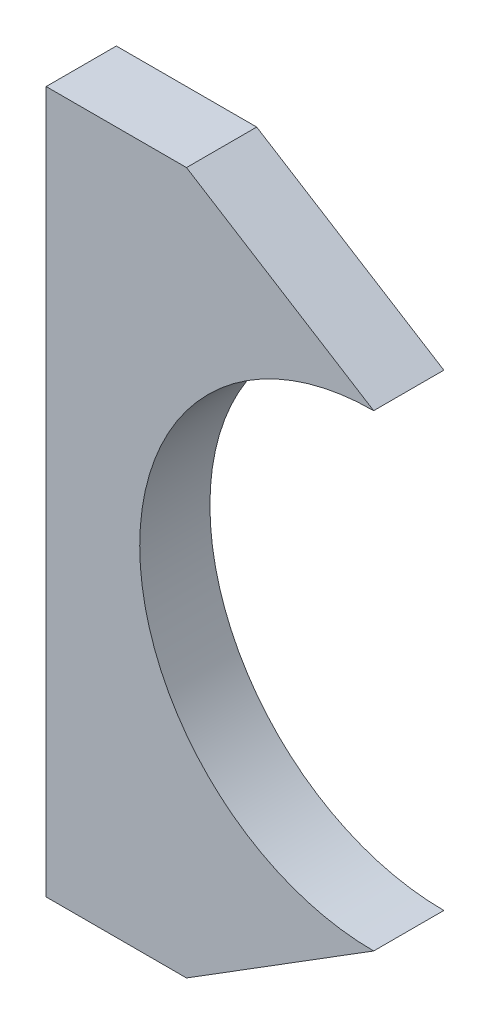
ISO-10303-21;
HEADER;
FILE_DESCRIPTION(('STEP AP214'),'2;1');
FILE_NAME('part.step','',(''),(''),'','','');
FILE_SCHEMA(('AUTOMOTIVE_DESIGN { 1 0 10303 214 1 1 1 1 }'));
ENDSEC;
DATA;
#1=APPLICATION_CONTEXT('core data for automotive mechanical design processes');
#2=APPLICATION_PROTOCOL_DEFINITION('international standard','automotive_design',2000,#1);
#3=PRODUCT_CONTEXT('',#1,'mechanical');
#4=PRODUCT('Part','Part','',(#3));
#5=PRODUCT_RELATED_PRODUCT_CATEGORY('part','',(#4));
#6=PRODUCT_DEFINITION_FORMATION('','',#4);
#7=PRODUCT_DEFINITION_CONTEXT('part definition',#1,'design');
#8=PRODUCT_DEFINITION('design','',#6,#7);
#9=PRODUCT_DEFINITION_SHAPE('','',#8);
#10=(LENGTH_UNIT() NAMED_UNIT(*) SI_UNIT(.MILLI.,.METRE.));
#11=(NAMED_UNIT(*) PLANE_ANGLE_UNIT() SI_UNIT($,.RADIAN.));
#12=(NAMED_UNIT(*) SI_UNIT($,.STERADIAN.) SOLID_ANGLE_UNIT());
#13=UNCERTAINTY_MEASURE_WITH_UNIT(LENGTH_MEASURE(1.E-05),#10,'distance_accuracy_value','');
#14=(GEOMETRIC_REPRESENTATION_CONTEXT(3) GLOBAL_UNCERTAINTY_ASSIGNED_CONTEXT((#13)) GLOBAL_UNIT_ASSIGNED_CONTEXT((#10,
#11,#12)) REPRESENTATION_CONTEXT('',''));
#15=CARTESIAN_POINT('',(0.,0.,0.));
#16=DIRECTION('',(0.,0.,1.));
#17=DIRECTION('',(1.,0.,0.));
#18=AXIS2_PLACEMENT_3D('',#15,#16,#17);
#19=CARTESIAN_POINT('',(0.,0.,7.5));
#20=DIRECTION('',(0.,0.,-1.));
#21=DIRECTION('',(-1.,0.,0.));
#22=AXIS2_PLACEMENT_3D('',#19,#20,#21);
#23=CYLINDRICAL_SURFACE('',#22,50.);
#24=CARTESIAN_POINT('',(0.,0.,-7.5));
#25=DIRECTION('',(0.,0.,-1.));
#26=DIRECTION('',(1.,0.,0.));
#27=AXIS2_PLACEMENT_3D('',#24,#25,#26);
#28=CIRCLE('',#27,50.);
#29=CARTESIAN_POINT('',(0.,-50.,-7.5));
#30=VERTEX_POINT('',#29);
#31=CARTESIAN_POINT('',(0.,50.,-7.5));
#32=VERTEX_POINT('',#31);
#33=EDGE_CURVE('E117',#30,#32,#28,.T.);
#34=ORIENTED_EDGE('',*,*,#33,.T.);
#35=DIRECTION('',(0.,0.,-1.));
#36=VECTOR('',#35,1.);
#37=CARTESIAN_POINT('',(0.,50.,7.5));
#38=LINE('',#37,#36);
#39=CARTESIAN_POINT('',(0.,50.,7.5));
#40=VERTEX_POINT('',#39);
#41=EDGE_CURVE('E11',#40,#32,#38,.T.);
#42=ORIENTED_EDGE('',*,*,#41,.F.);
#43=CARTESIAN_POINT('',(0.,0.,7.5));
#44=DIRECTION('',(0.,0.,-1.));
#45=DIRECTION('',(1.,0.,0.));
#46=AXIS2_PLACEMENT_3D('',#43,#44,#45);
#47=CIRCLE('',#46,50.);
#48=CARTESIAN_POINT('',(0.,-50.,7.5));
#49=VERTEX_POINT('',#48);
#50=EDGE_CURVE('E127',#49,#40,#47,.T.);
#51=ORIENTED_EDGE('',*,*,#50,.F.);
#52=DIRECTION('',(0.,0.,-1.));
#53=VECTOR('',#52,1.);
#54=CARTESIAN_POINT('',(0.,-50.,7.5));
#55=LINE('',#54,#53);
#56=EDGE_CURVE('E113',#49,#30,#55,.T.);
#57=ORIENTED_EDGE('',*,*,#56,.T.);
#58=EDGE_LOOP('',(#34,#42,#51,#57));
#59=FACE_BOUND('',#58,.T.);
#60=ADVANCED_FACE('F33',(#59),#23,.F.);
#61=CARTESIAN_POINT('',(0.,50.,7.5));
#62=DIRECTION('',(-0.52999894000318,-0.847998304005088,0.));
#63=DIRECTION('',(0.847998304005088,-0.52999894000318,0.));
#64=AXIS2_PLACEMENT_3D('',#61,#62,#63);
#65=PLANE('',#64);
#66=DIRECTION('',(-0.847998304005088,0.52999894000318,0.));
#67=VECTOR('',#66,1.);
#68=CARTESIAN_POINT('',(0.,50.,-7.5));
#69=LINE('',#68,#67);
#70=CARTESIAN_POINT('',(-40.,75.,-7.5));
#71=VERTEX_POINT('',#70);
#72=EDGE_CURVE('E120',#32,#71,#69,.T.);
#73=ORIENTED_EDGE('',*,*,#72,.T.);
#74=DIRECTION('',(0.,0.,-1.));
#75=VECTOR('',#74,1.);
#76=CARTESIAN_POINT('',(-40.,75.,7.5));
#77=LINE('',#76,#75);
#78=CARTESIAN_POINT('',(-40.,75.,7.5));
#79=VERTEX_POINT('',#78);
#80=EDGE_CURVE('E41',#79,#71,#77,.T.);
#81=ORIENTED_EDGE('',*,*,#80,.F.);
#82=DIRECTION('',(-0.847998304005088,0.52999894000318,0.));
#83=VECTOR('',#82,1.);
#84=CARTESIAN_POINT('',(0.,50.,7.5));
#85=LINE('',#84,#83);
#86=EDGE_CURVE('E86',#40,#79,#85,.T.);
#87=ORIENTED_EDGE('',*,*,#86,.F.);
#88=ORIENTED_EDGE('',*,*,#41,.T.);
#89=EDGE_LOOP('',(#73,#81,#87,#88));
#90=FACE_BOUND('',#89,.T.);
#91=ADVANCED_FACE('F151',(#90),#65,.F.);
#92=CARTESIAN_POINT('',(-40.,75.,7.5));
#93=DIRECTION('',(0.,-1.,0.));
#94=DIRECTION('',(1.,0.,0.));
#95=AXIS2_PLACEMENT_3D('',#92,#93,#94);
#96=PLANE('',#95);
#97=DIRECTION('',(-1.,0.,0.));
#98=VECTOR('',#97,1.);
#99=CARTESIAN_POINT('',(-40.,75.,-7.5));
#100=LINE('',#99,#98);
#101=CARTESIAN_POINT('',(-70.,75.,-7.5));
#102=VERTEX_POINT('',#101);
#103=EDGE_CURVE('E122',#71,#102,#100,.T.);
#104=ORIENTED_EDGE('',*,*,#103,.T.);
#105=DIRECTION('',(0.,0.,-1.));
#106=VECTOR('',#105,1.);
#107=CARTESIAN_POINT('',(-70.,75.,7.5));
#108=LINE('',#107,#106);
#109=CARTESIAN_POINT('',(-70.,75.,7.5));
#110=VERTEX_POINT('',#109);
#111=EDGE_CURVE('E108',#110,#102,#108,.T.);
#112=ORIENTED_EDGE('',*,*,#111,.F.);
#113=DIRECTION('',(-1.,0.,0.));
#114=VECTOR('',#113,1.);
#115=CARTESIAN_POINT('',(-40.,75.,7.5));
#116=LINE('',#115,#114);
#117=EDGE_CURVE('E99',#79,#110,#116,.T.);
#118=ORIENTED_EDGE('',*,*,#117,.F.);
#119=ORIENTED_EDGE('',*,*,#80,.T.);
#120=EDGE_LOOP('',(#104,#112,#118,#119));
#121=FACE_BOUND('',#120,.T.);
#122=ADVANCED_FACE('F133',(#121),#96,.F.);
#123=CARTESIAN_POINT('',(-70.,75.,7.5));
#124=DIRECTION('',(1.,0.,0.));
#125=DIRECTION('',(0.,1.,0.));
#126=AXIS2_PLACEMENT_3D('',#123,#124,#125);
#127=PLANE('',#126);
#128=DIRECTION('',(0.,-1.,0.));
#129=VECTOR('',#128,1.);
#130=CARTESIAN_POINT('',(-70.,75.,-7.5));
#131=LINE('',#130,#129);
#132=CARTESIAN_POINT('',(-70.,-75.,-7.5));
#133=VERTEX_POINT('',#132);
#134=EDGE_CURVE('E107',#102,#133,#131,.T.);
#135=ORIENTED_EDGE('',*,*,#134,.T.);
#136=DIRECTION('',(0.,0.,-1.));
#137=VECTOR('',#136,1.);
#138=CARTESIAN_POINT('',(-70.,-75.,7.5));
#139=LINE('',#138,#137);
#140=CARTESIAN_POINT('',(-70.,-75.,7.5));
#141=VERTEX_POINT('',#140);
#142=EDGE_CURVE('E104',#141,#133,#139,.T.);
#143=ORIENTED_EDGE('',*,*,#142,.F.);
#144=DIRECTION('',(0.,-1.,0.));
#145=VECTOR('',#144,1.);
#146=CARTESIAN_POINT('',(-70.,75.,7.5));
#147=LINE('',#146,#145);
#148=EDGE_CURVE('E93',#110,#141,#147,.T.);
#149=ORIENTED_EDGE('',*,*,#148,.F.);
#150=ORIENTED_EDGE('',*,*,#111,.T.);
#151=EDGE_LOOP('',(#135,#143,#149,#150));
#152=FACE_BOUND('',#151,.T.);
#153=ADVANCED_FACE('F105',(#152),#127,.F.);
#154=CARTESIAN_POINT('',(-70.,-75.,7.5));
#155=DIRECTION('',(0.,1.,0.));
#156=DIRECTION('',(-1.,0.,0.));
#157=AXIS2_PLACEMENT_3D('',#154,#155,#156);
#158=PLANE('',#157);
#159=DIRECTION('',(1.,0.,0.));
#160=VECTOR('',#159,1.);
#161=CARTESIAN_POINT('',(-70.,-75.,-7.5));
#162=LINE('',#161,#160);
#163=CARTESIAN_POINT('',(-40.,-75.,-7.5));
#164=VERTEX_POINT('',#163);
#165=EDGE_CURVE('E72',#133,#164,#162,.T.);
#166=ORIENTED_EDGE('',*,*,#165,.T.);
#167=DIRECTION('',(0.,0.,-1.));
#168=VECTOR('',#167,1.);
#169=CARTESIAN_POINT('',(-40.,-75.,7.5));
#170=LINE('',#169,#168);
#171=CARTESIAN_POINT('',(-40.,-75.,7.5));
#172=VERTEX_POINT('',#171);
#173=EDGE_CURVE('E109',#172,#164,#170,.T.);
#174=ORIENTED_EDGE('',*,*,#173,.F.);
#175=DIRECTION('',(1.,0.,0.));
#176=VECTOR('',#175,1.);
#177=CARTESIAN_POINT('',(-70.,-75.,7.5));
#178=LINE('',#177,#176);
#179=EDGE_CURVE('E97',#141,#172,#178,.T.);
#180=ORIENTED_EDGE('',*,*,#179,.F.);
#181=ORIENTED_EDGE('',*,*,#142,.T.);
#182=EDGE_LOOP('',(#166,#174,#180,#181));
#183=FACE_BOUND('',#182,.T.);
#184=ADVANCED_FACE('F111',(#183),#158,.F.);
#185=CARTESIAN_POINT('',(-40.,-75.,7.5));
#186=DIRECTION('',(-0.52999894000318,0.847998304005088,0.));
#187=DIRECTION('',(-0.847998304005088,-0.52999894000318,0.));
#188=AXIS2_PLACEMENT_3D('',#185,#186,#187);
#189=PLANE('',#188);
#190=DIRECTION('',(0.847998304005088,0.52999894000318,0.));
#191=VECTOR('',#190,1.);
#192=CARTESIAN_POINT('',(-40.,-75.,-7.5));
#193=LINE('',#192,#191);
#194=EDGE_CURVE('E78',#164,#30,#193,.T.);
#195=ORIENTED_EDGE('',*,*,#194,.T.);
#196=ORIENTED_EDGE('',*,*,#56,.F.);
#197=DIRECTION('',(0.847998304005088,0.52999894000318,0.));
#198=VECTOR('',#197,1.);
#199=CARTESIAN_POINT('',(-40.,-75.,7.5));
#200=LINE('',#199,#198);
#201=EDGE_CURVE('E49',#172,#49,#200,.T.);
#202=ORIENTED_EDGE('',*,*,#201,.F.);
#203=ORIENTED_EDGE('',*,*,#173,.T.);
#204=EDGE_LOOP('',(#195,#196,#202,#203));
#205=FACE_BOUND('',#204,.T.);
#206=ADVANCED_FACE('F140',(#205),#189,.F.);
#207=CARTESIAN_POINT('',(0.,0.,7.5));
#208=DIRECTION('',(0.,0.,1.));
#209=DIRECTION('',(1.,0.,0.));
#210=AXIS2_PLACEMENT_3D('',#207,#208,#209);
#211=PLANE('',#210);
#212=ORIENTED_EDGE('',*,*,#50,.T.);
#213=ORIENTED_EDGE('',*,*,#86,.T.);
#214=ORIENTED_EDGE('',*,*,#117,.T.);
#215=ORIENTED_EDGE('',*,*,#148,.T.);
#216=ORIENTED_EDGE('',*,*,#179,.T.);
#217=ORIENTED_EDGE('',*,*,#201,.T.);
#218=EDGE_LOOP('',(#212,#213,#214,#215,#216,#217));
#219=FACE_BOUND('',#218,.T.);
#220=ADVANCED_FACE('F95',(#219),#211,.T.);
#221=CARTESIAN_POINT('',(0.,0.,-7.5));
#222=DIRECTION('',(0.,0.,1.));
#223=DIRECTION('',(1.,0.,0.));
#224=AXIS2_PLACEMENT_3D('',#221,#222,#223);
#225=PLANE('',#224);
#226=ORIENTED_EDGE('',*,*,#33,.F.);
#227=ORIENTED_EDGE('',*,*,#194,.F.);
#228=ORIENTED_EDGE('',*,*,#165,.F.);
#229=ORIENTED_EDGE('',*,*,#134,.F.);
#230=ORIENTED_EDGE('',*,*,#103,.F.);
#231=ORIENTED_EDGE('',*,*,#72,.F.);
#232=EDGE_LOOP('',(#226,#227,#228,#229,#230,#231));
#233=FACE_BOUND('',#232,.T.);
#234=ADVANCED_FACE('F136',(#233),#225,.F.);
#235=CLOSED_SHELL('',(#60,#91,#122,#153,#184,#206,#220,#234));
#236=MANIFOLD_SOLID_BREP('B2',#235);
#237=ADVANCED_BREP_SHAPE_REPRESENTATION('',(#18,#236),#14);
#238=SHAPE_DEFINITION_REPRESENTATION(#9,#237);
ENDSEC;
END-ISO-10303-21;
